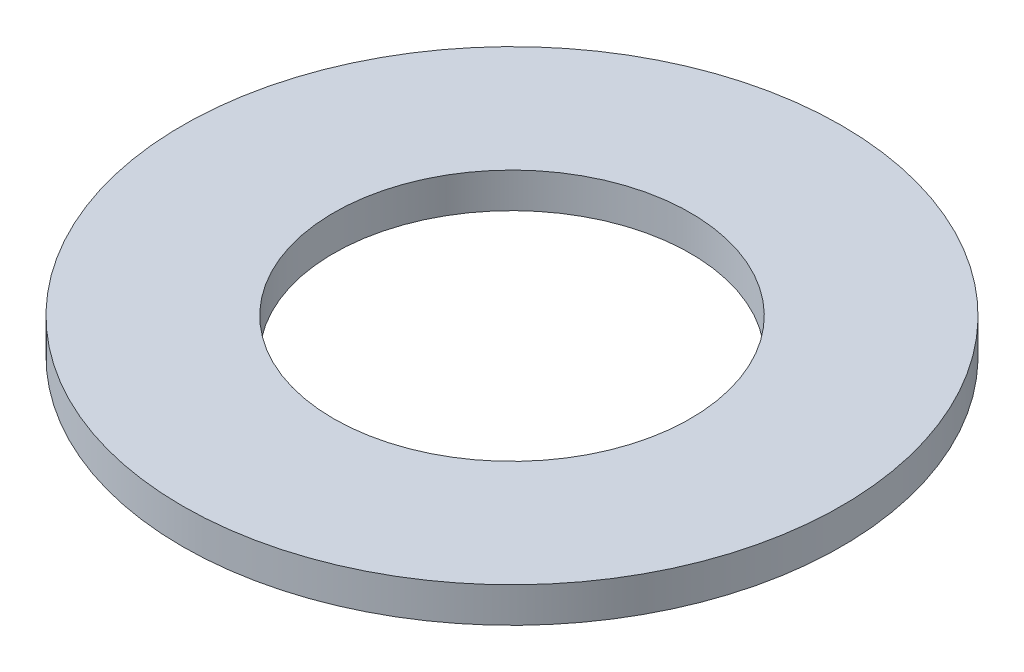
ISO-10303-21;
HEADER;
FILE_DESCRIPTION(('STEP AP214'),'2;1');
FILE_NAME('part.step','',(''),(''),'','','');
FILE_SCHEMA(('AUTOMOTIVE_DESIGN { 1 0 10303 214 1 1 1 1 }'));
ENDSEC;
DATA;
#1=APPLICATION_CONTEXT('core data for automotive mechanical design processes');
#2=APPLICATION_PROTOCOL_DEFINITION('international standard','automotive_design',2000,#1);
#3=PRODUCT_CONTEXT('',#1,'mechanical');
#4=PRODUCT('Part','Part','',(#3));
#5=PRODUCT_RELATED_PRODUCT_CATEGORY('part','',(#4));
#6=PRODUCT_DEFINITION_FORMATION('','',#4);
#7=PRODUCT_DEFINITION_CONTEXT('part definition',#1,'design');
#8=PRODUCT_DEFINITION('design','',#6,#7);
#9=PRODUCT_DEFINITION_SHAPE('','',#8);
#10=(LENGTH_UNIT() NAMED_UNIT(*) SI_UNIT(.MILLI.,.METRE.));
#11=(NAMED_UNIT(*) PLANE_ANGLE_UNIT() SI_UNIT($,.RADIAN.));
#12=(NAMED_UNIT(*) SI_UNIT($,.STERADIAN.) SOLID_ANGLE_UNIT());
#13=UNCERTAINTY_MEASURE_WITH_UNIT(LENGTH_MEASURE(1.E-05),#10,'distance_accuracy_value','');
#14=(GEOMETRIC_REPRESENTATION_CONTEXT(3) GLOBAL_UNCERTAINTY_ASSIGNED_CONTEXT((#13)) GLOBAL_UNIT_ASSIGNED_CONTEXT((#10,
#11,#12)) REPRESENTATION_CONTEXT('',''));
#15=CARTESIAN_POINT('',(0.,0.,0.));
#16=DIRECTION('',(0.,0.,1.));
#17=DIRECTION('',(1.,0.,0.));
#18=AXIS2_PLACEMENT_3D('',#15,#16,#17);
#19=CARTESIAN_POINT('',(0.,1.016,0.));
#20=DIRECTION('',(0.,-1.,0.));
#21=DIRECTION('',(0.,0.,-1.));
#22=AXIS2_PLACEMENT_3D('',#19,#20,#21);
#23=CYLINDRICAL_SURFACE('',#22,9.525);
#24=CARTESIAN_POINT('',(0.,1.016,0.));
#25=DIRECTION('',(0.,1.,0.));
#26=DIRECTION('',(0.,0.,1.));
#27=AXIS2_PLACEMENT_3D('',#24,#25,#26);
#28=CIRCLE('',#27,9.525);
#29=CARTESIAN_POINT('',(0.,1.016,9.525));
#30=VERTEX_POINT('',#29);
#31=EDGE_CURVE('E10',#30,#30,#28,.T.);
#32=ORIENTED_EDGE('',*,*,#31,.F.);
#33=EDGE_LOOP('',(#32));
#34=FACE_BOUND('',#33,.T.);
#35=CARTESIAN_POINT('',(0.,0.,0.));
#36=DIRECTION('',(0.,1.,0.));
#37=DIRECTION('',(0.,0.,1.));
#38=AXIS2_PLACEMENT_3D('',#35,#36,#37);
#39=CIRCLE('',#38,9.525);
#40=CARTESIAN_POINT('',(0.,0.,9.525));
#41=VERTEX_POINT('',#40);
#42=EDGE_CURVE('E33',#41,#41,#39,.T.);
#43=ORIENTED_EDGE('',*,*,#42,.T.);
#44=EDGE_LOOP('',(#43));
#45=FACE_BOUND('',#44,.T.);
#46=ADVANCED_FACE('F30',(#34,#45),#23,.T.);
#47=CARTESIAN_POINT('',(0.,1.016,0.));
#48=DIRECTION('',(0.,1.,0.));
#49=DIRECTION('',(0.,0.,1.));
#50=AXIS2_PLACEMENT_3D('',#47,#48,#49);
#51=PLANE('',#50);
#52=CARTESIAN_POINT('',(0.,1.016,0.));
#53=DIRECTION('',(0.,1.,0.));
#54=DIRECTION('',(0.,0.,1.));
#55=AXIS2_PLACEMENT_3D('',#52,#53,#54);
#56=CIRCLE('',#55,5.1562);
#57=CARTESIAN_POINT('',(0.,1.016,5.1562));
#58=VERTEX_POINT('',#57);
#59=EDGE_CURVE('E42',#58,#58,#56,.T.);
#60=ORIENTED_EDGE('',*,*,#59,.F.);
#61=EDGE_LOOP('',(#60));
#62=FACE_BOUND('',#61,.T.);
#63=ORIENTED_EDGE('',*,*,#31,.T.);
#64=EDGE_LOOP('',(#63));
#65=FACE_BOUND('',#64,.T.);
#66=ADVANCED_FACE('F57',(#62,#65),#51,.T.);
#67=CARTESIAN_POINT('',(0.,0.,0.));
#68=DIRECTION('',(0.,1.,0.));
#69=DIRECTION('',(0.,0.,1.));
#70=AXIS2_PLACEMENT_3D('',#67,#68,#69);
#71=PLANE('',#70);
#72=CARTESIAN_POINT('',(0.,0.,0.));
#73=DIRECTION('',(0.,1.,0.));
#74=DIRECTION('',(0.,0.,1.));
#75=AXIS2_PLACEMENT_3D('',#72,#73,#74);
#76=CIRCLE('',#75,5.1562);
#77=CARTESIAN_POINT('',(0.,0.,5.1562));
#78=VERTEX_POINT('',#77);
#79=EDGE_CURVE('E40',#78,#78,#76,.T.);
#80=ORIENTED_EDGE('',*,*,#79,.T.);
#81=EDGE_LOOP('',(#80));
#82=FACE_BOUND('',#81,.T.);
#83=ORIENTED_EDGE('',*,*,#42,.F.);
#84=EDGE_LOOP('',(#83));
#85=FACE_BOUND('',#84,.T.);
#86=ADVANCED_FACE('F48',(#82,#85),#71,.F.);
#87=CARTESIAN_POINT('',(0.,0.,0.));
#88=DIRECTION('',(0.,1.,0.));
#89=DIRECTION('',(0.,0.,1.));
#90=AXIS2_PLACEMENT_3D('',#87,#88,#89);
#91=CYLINDRICAL_SURFACE('',#90,5.1562);
#92=ORIENTED_EDGE('',*,*,#79,.F.);
#93=EDGE_LOOP('',(#92));
#94=FACE_BOUND('',#93,.T.);
#95=ORIENTED_EDGE('',*,*,#59,.T.);
#96=EDGE_LOOP('',(#95));
#97=FACE_BOUND('',#96,.T.);
#98=ADVANCED_FACE('F51',(#94,#97),#91,.F.);
#99=CLOSED_SHELL('',(#46,#66,#86,#98));
#100=MANIFOLD_SOLID_BREP('B2',#99);
#101=ADVANCED_BREP_SHAPE_REPRESENTATION('',(#18,#100),#14);
#102=SHAPE_DEFINITION_REPRESENTATION(#9,#101);
ENDSEC;
END-ISO-10303-21;
